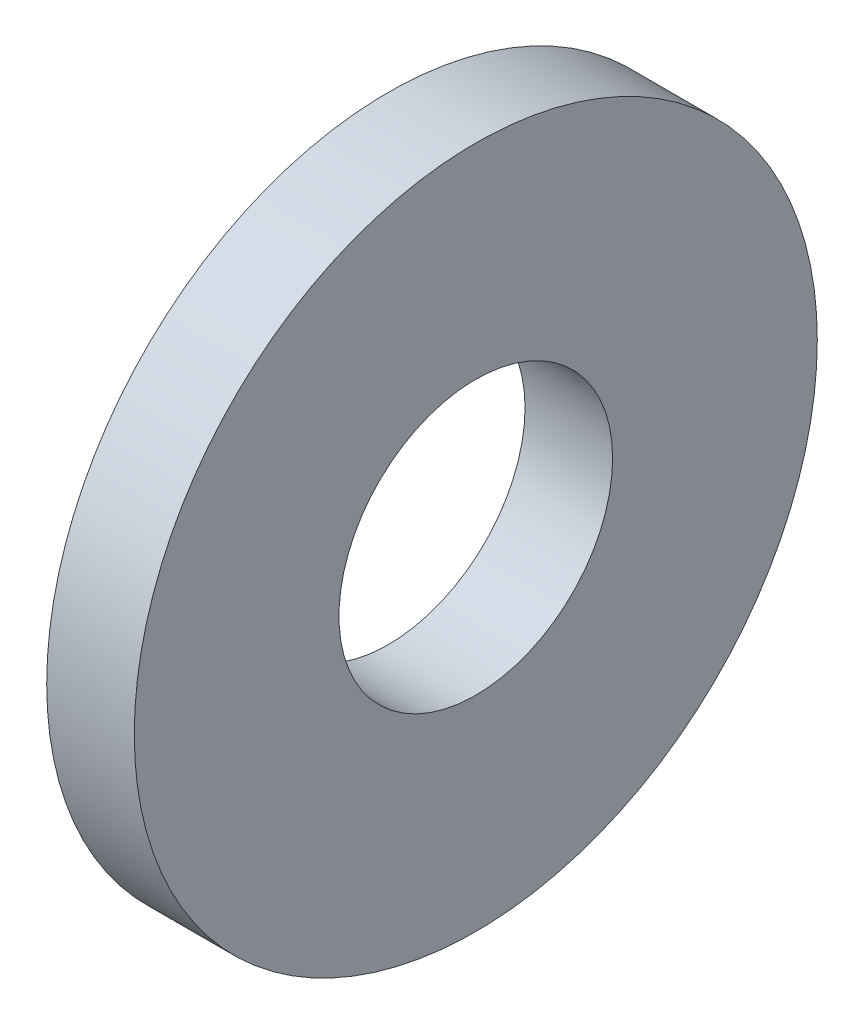
ISO-10303-21;
HEADER;
FILE_DESCRIPTION(('STEP AP214'),'2;1');
FILE_NAME('part.step','',(''),(''),'','','');
FILE_SCHEMA(('AUTOMOTIVE_DESIGN { 1 0 10303 214 1 1 1 1 }'));
ENDSEC;
DATA;
#1=APPLICATION_CONTEXT('core data for automotive mechanical design processes');
#2=APPLICATION_PROTOCOL_DEFINITION('international standard','automotive_design',2000,#1);
#3=PRODUCT_CONTEXT('',#1,'mechanical');
#4=PRODUCT('Part','Part','',(#3));
#5=PRODUCT_RELATED_PRODUCT_CATEGORY('part','',(#4));
#6=PRODUCT_DEFINITION_FORMATION('','',#4);
#7=PRODUCT_DEFINITION_CONTEXT('part definition',#1,'design');
#8=PRODUCT_DEFINITION('design','',#6,#7);
#9=PRODUCT_DEFINITION_SHAPE('','',#8);
#10=(LENGTH_UNIT() NAMED_UNIT(*) SI_UNIT(.MILLI.,.METRE.));
#11=(NAMED_UNIT(*) PLANE_ANGLE_UNIT() SI_UNIT($,.RADIAN.));
#12=(NAMED_UNIT(*) SI_UNIT($,.STERADIAN.) SOLID_ANGLE_UNIT());
#13=UNCERTAINTY_MEASURE_WITH_UNIT(LENGTH_MEASURE(1.E-05),#10,'distance_accuracy_value','');
#14=(GEOMETRIC_REPRESENTATION_CONTEXT(3) GLOBAL_UNCERTAINTY_ASSIGNED_CONTEXT((#13)) GLOBAL_UNIT_ASSIGNED_CONTEXT((#10,
#11,#12)) REPRESENTATION_CONTEXT('',''));
#15=CARTESIAN_POINT('',(0.,0.,0.));
#16=DIRECTION('',(0.,0.,1.));
#17=DIRECTION('',(1.,0.,0.));
#18=AXIS2_PLACEMENT_3D('',#15,#16,#17);
#19=CARTESIAN_POINT('',(1.016,0.,0.));
#20=DIRECTION('',(1.,0.,0.));
#21=DIRECTION('',(0.,0.,-1.));
#22=AXIS2_PLACEMENT_3D('',#19,#20,#21);
#23=PLANE('',#22);
#24=CARTESIAN_POINT('',(1.016,0.,0.));
#25=DIRECTION('',(1.,0.,0.));
#26=DIRECTION('',(0.,0.,-1.));
#27=AXIS2_PLACEMENT_3D('',#24,#25,#26);
#28=CIRCLE('',#27,3.9624);
#29=CARTESIAN_POINT('',(1.016,0.,-3.9624));
#30=VERTEX_POINT('',#29);
#31=EDGE_CURVE('E10',#30,#30,#28,.T.);
#32=ORIENTED_EDGE('',*,*,#31,.T.);
#33=EDGE_LOOP('',(#32));
#34=FACE_BOUND('',#33,.T.);
#35=CARTESIAN_POINT('',(1.016,0.,0.));
#36=DIRECTION('',(1.,0.,0.));
#37=DIRECTION('',(0.,0.,-1.));
#38=AXIS2_PLACEMENT_3D('',#35,#36,#37);
#39=CIRCLE('',#38,1.5875);
#40=CARTESIAN_POINT('',(1.016,0.,-1.5875));
#41=VERTEX_POINT('',#40);
#42=EDGE_CURVE('E41',#41,#41,#39,.T.);
#43=ORIENTED_EDGE('',*,*,#42,.F.);
#44=EDGE_LOOP('',(#43));
#45=FACE_BOUND('',#44,.T.);
#46=ADVANCED_FACE('F30',(#34,#45),#23,.T.);
#47=CARTESIAN_POINT('',(0.,0.,0.));
#48=DIRECTION('',(1.,0.,0.));
#49=DIRECTION('',(0.,0.,-1.));
#50=AXIS2_PLACEMENT_3D('',#47,#48,#49);
#51=PLANE('',#50);
#52=CARTESIAN_POINT('',(0.,0.,0.));
#53=DIRECTION('',(1.,0.,0.));
#54=DIRECTION('',(0.,0.,-1.));
#55=AXIS2_PLACEMENT_3D('',#52,#53,#54);
#56=CIRCLE('',#55,3.9624);
#57=CARTESIAN_POINT('',(0.,0.,-3.9624));
#58=VERTEX_POINT('',#57);
#59=EDGE_CURVE('E34',#58,#58,#56,.T.);
#60=ORIENTED_EDGE('',*,*,#59,.F.);
#61=EDGE_LOOP('',(#60));
#62=FACE_BOUND('',#61,.T.);
#63=CARTESIAN_POINT('',(0.,0.,0.));
#64=DIRECTION('',(1.,0.,0.));
#65=DIRECTION('',(0.,0.,-1.));
#66=AXIS2_PLACEMENT_3D('',#63,#64,#65);
#67=CIRCLE('',#66,1.5875);
#68=CARTESIAN_POINT('',(0.,0.,-1.5875));
#69=VERTEX_POINT('',#68);
#70=EDGE_CURVE('E43',#69,#69,#67,.T.);
#71=ORIENTED_EDGE('',*,*,#70,.T.);
#72=EDGE_LOOP('',(#71));
#73=FACE_BOUND('',#72,.T.);
#74=ADVANCED_FACE('F53',(#62,#73),#51,.F.);
#75=CARTESIAN_POINT('',(1.016,0.,0.));
#76=DIRECTION('',(-1.,0.,0.));
#77=DIRECTION('',(0.,0.,1.));
#78=AXIS2_PLACEMENT_3D('',#75,#76,#77);
#79=CYLINDRICAL_SURFACE('',#78,3.9624);
#80=ORIENTED_EDGE('',*,*,#31,.F.);
#81=EDGE_LOOP('',(#80));
#82=FACE_BOUND('',#81,.T.);
#83=ORIENTED_EDGE('',*,*,#59,.T.);
#84=EDGE_LOOP('',(#83));
#85=FACE_BOUND('',#84,.T.);
#86=ADVANCED_FACE('F32',(#82,#85),#79,.T.);
#87=CARTESIAN_POINT('',(1.016,0.,0.));
#88=DIRECTION('',(-1.,0.,0.));
#89=DIRECTION('',(0.,0.,1.));
#90=AXIS2_PLACEMENT_3D('',#87,#88,#89);
#91=CYLINDRICAL_SURFACE('',#90,1.5875);
#92=ORIENTED_EDGE('',*,*,#42,.T.);
#93=EDGE_LOOP('',(#92));
#94=FACE_BOUND('',#93,.T.);
#95=ORIENTED_EDGE('',*,*,#70,.F.);
#96=EDGE_LOOP('',(#95));
#97=FACE_BOUND('',#96,.T.);
#98=ADVANCED_FACE('F49',(#94,#97),#91,.F.);
#99=CLOSED_SHELL('',(#46,#74,#86,#98));
#100=MANIFOLD_SOLID_BREP('B2',#99);
#101=ADVANCED_BREP_SHAPE_REPRESENTATION('',(#18,#100),#14);
#102=SHAPE_DEFINITION_REPRESENTATION(#9,#101);
ENDSEC;
END-ISO-10303-21;
